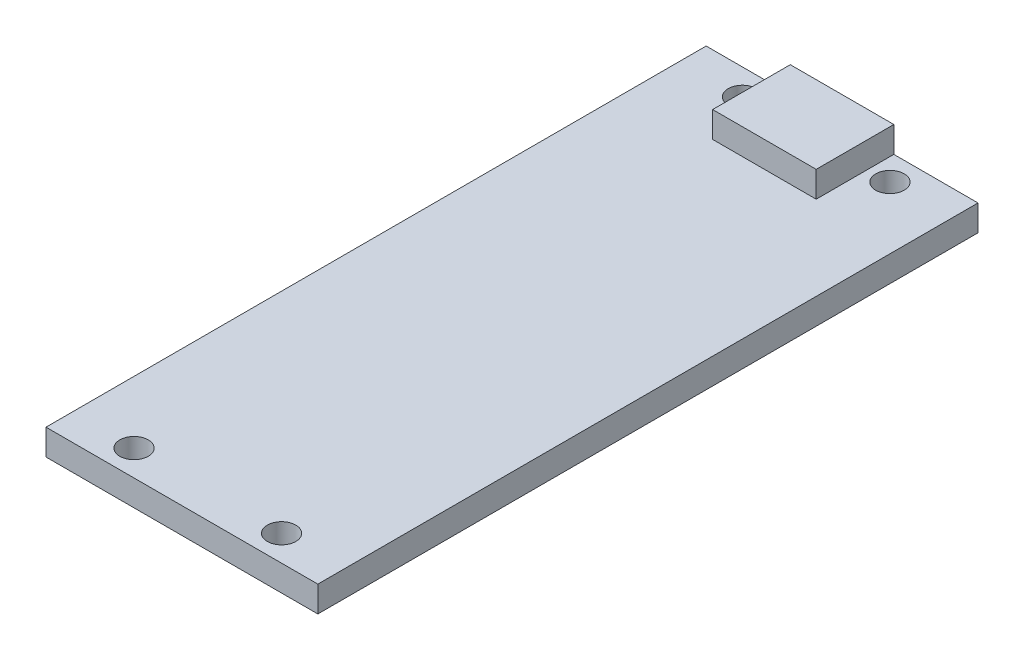
ISO-10303-21;
HEADER;
FILE_DESCRIPTION(('STEP AP214'),'2;1');
FILE_NAME('part.step','',(''),(''),'','','');
FILE_SCHEMA(('AUTOMOTIVE_DESIGN { 1 0 10303 214 1 1 1 1 }'));
ENDSEC;
DATA;
#1=APPLICATION_CONTEXT('core data for automotive mechanical design processes');
#2=APPLICATION_PROTOCOL_DEFINITION('international standard','automotive_design',2000,#1);
#3=PRODUCT_CONTEXT('',#1,'mechanical');
#4=PRODUCT('Part','Part','',(#3));
#5=PRODUCT_RELATED_PRODUCT_CATEGORY('part','',(#4));
#6=PRODUCT_DEFINITION_FORMATION('','',#4);
#7=PRODUCT_DEFINITION_CONTEXT('part definition',#1,'design');
#8=PRODUCT_DEFINITION('design','',#6,#7);
#9=PRODUCT_DEFINITION_SHAPE('','',#8);
#10=(LENGTH_UNIT() NAMED_UNIT(*) SI_UNIT(.MILLI.,.METRE.));
#11=(NAMED_UNIT(*) PLANE_ANGLE_UNIT() SI_UNIT($,.RADIAN.));
#12=(NAMED_UNIT(*) SI_UNIT($,.STERADIAN.) SOLID_ANGLE_UNIT());
#13=UNCERTAINTY_MEASURE_WITH_UNIT(LENGTH_MEASURE(1.E-05),#10,'distance_accuracy_value','');
#14=(GEOMETRIC_REPRESENTATION_CONTEXT(3) GLOBAL_UNCERTAINTY_ASSIGNED_CONTEXT((#13)) GLOBAL_UNIT_ASSIGNED_CONTEXT((#10,
#11,#12)) REPRESENTATION_CONTEXT('',''));
#15=CARTESIAN_POINT('',(0.,0.,0.));
#16=DIRECTION('',(0.,0.,1.));
#17=DIRECTION('',(1.,0.,0.));
#18=AXIS2_PLACEMENT_3D('',#15,#16,#17);
#19=CARTESIAN_POINT('',(-10.5,2.,-25.5));
#20=DIRECTION('',(1.,0.,0.));
#21=DIRECTION('',(0.,0.,-1.));
#22=AXIS2_PLACEMENT_3D('',#19,#20,#21);
#23=PLANE('',#22);
#24=DIRECTION('',(0.,0.,1.));
#25=VECTOR('',#24,1.);
#26=CARTESIAN_POINT('',(-10.5,0.,-25.5));
#27=LINE('',#26,#25);
#28=CARTESIAN_POINT('',(-10.5,0.,-25.5));
#29=VERTEX_POINT('',#28);
#30=CARTESIAN_POINT('',(-10.5,0.,25.5));
#31=VERTEX_POINT('',#30);
#32=EDGE_CURVE('E121',#29,#31,#27,.T.);
#33=ORIENTED_EDGE('',*,*,#32,.T.);
#34=DIRECTION('',(0.,-1.,0.));
#35=VECTOR('',#34,1.);
#36=CARTESIAN_POINT('',(-10.5,2.,25.5));
#37=LINE('',#36,#35);
#38=CARTESIAN_POINT('',(-10.5,2.,25.5));
#39=VERTEX_POINT('',#38);
#40=EDGE_CURVE('E11',#39,#31,#37,.T.);
#41=ORIENTED_EDGE('',*,*,#40,.F.);
#42=DIRECTION('',(0.,0.,1.));
#43=VECTOR('',#42,1.);
#44=CARTESIAN_POINT('',(-10.5,2.,-25.5));
#45=LINE('',#44,#43);
#46=CARTESIAN_POINT('',(-10.5,2.,-25.5));
#47=VERTEX_POINT('',#46);
#48=EDGE_CURVE('E130',#47,#39,#45,.T.);
#49=ORIENTED_EDGE('',*,*,#48,.F.);
#50=DIRECTION('',(0.,-1.,0.));
#51=VECTOR('',#50,1.);
#52=CARTESIAN_POINT('',(-10.5,2.,-25.5));
#53=LINE('',#52,#51);
#54=EDGE_CURVE('E140',#47,#29,#53,.T.);
#55=ORIENTED_EDGE('',*,*,#54,.T.);
#56=EDGE_LOOP('',(#33,#41,#49,#55));
#57=FACE_BOUND('',#56,.T.);
#58=ADVANCED_FACE('F37',(#57),#23,.F.);
#59=CARTESIAN_POINT('',(-10.5,2.,25.5));
#60=DIRECTION('',(0.,0.,-1.));
#61=DIRECTION('',(-1.,0.,0.));
#62=AXIS2_PLACEMENT_3D('',#59,#60,#61);
#63=PLANE('',#62);
#64=DIRECTION('',(1.,0.,0.));
#65=VECTOR('',#64,1.);
#66=CARTESIAN_POINT('',(-10.5,0.,25.5));
#67=LINE('',#66,#65);
#68=CARTESIAN_POINT('',(10.5,0.,25.5));
#69=VERTEX_POINT('',#68);
#70=EDGE_CURVE('E124',#31,#69,#67,.T.);
#71=ORIENTED_EDGE('',*,*,#70,.T.);
#72=DIRECTION('',(0.,-1.,0.));
#73=VECTOR('',#72,1.);
#74=CARTESIAN_POINT('',(10.5,2.,25.5));
#75=LINE('',#74,#73);
#76=CARTESIAN_POINT('',(10.5,2.,25.5));
#77=VERTEX_POINT('',#76);
#78=EDGE_CURVE('E44',#77,#69,#75,.T.);
#79=ORIENTED_EDGE('',*,*,#78,.F.);
#80=DIRECTION('',(1.,0.,0.));
#81=VECTOR('',#80,1.);
#82=CARTESIAN_POINT('',(-10.5,2.,25.5));
#83=LINE('',#82,#81);
#84=EDGE_CURVE('E133',#39,#77,#83,.T.);
#85=ORIENTED_EDGE('',*,*,#84,.F.);
#86=ORIENTED_EDGE('',*,*,#40,.T.);
#87=EDGE_LOOP('',(#71,#79,#85,#86));
#88=FACE_BOUND('',#87,.T.);
#89=ADVANCED_FACE('F229',(#88),#63,.F.);
#90=CARTESIAN_POINT('',(10.5,2.,-25.5));
#91=DIRECTION('',(-1.,0.,0.));
#92=DIRECTION('',(0.,0.,1.));
#93=AXIS2_PLACEMENT_3D('',#90,#91,#92);
#94=PLANE('',#93);
#95=DIRECTION('',(0.,0.,-1.));
#96=VECTOR('',#95,1.);
#97=CARTESIAN_POINT('',(10.5,0.,-25.5));
#98=LINE('',#97,#96);
#99=CARTESIAN_POINT('',(10.5,0.,-25.5));
#100=VERTEX_POINT('',#99);
#101=EDGE_CURVE('E143',#69,#100,#98,.T.);
#102=ORIENTED_EDGE('',*,*,#101,.T.);
#103=DIRECTION('',(0.,-1.,0.));
#104=VECTOR('',#103,1.);
#105=CARTESIAN_POINT('',(10.5,2.,-25.5));
#106=LINE('',#105,#104);
#107=CARTESIAN_POINT('',(10.5,2.,-25.5));
#108=VERTEX_POINT('',#107);
#109=EDGE_CURVE('E148',#108,#100,#106,.T.);
#110=ORIENTED_EDGE('',*,*,#109,.F.);
#111=DIRECTION('',(0.,0.,-1.));
#112=VECTOR('',#111,1.);
#113=CARTESIAN_POINT('',(10.5,2.,-25.5));
#114=LINE('',#113,#112);
#115=EDGE_CURVE('E136',#77,#108,#114,.T.);
#116=ORIENTED_EDGE('',*,*,#115,.F.);
#117=ORIENTED_EDGE('',*,*,#78,.T.);
#118=EDGE_LOOP('',(#102,#110,#116,#117));
#119=FACE_BOUND('',#118,.T.);
#120=ADVANCED_FACE('F155',(#119),#94,.F.);
#121=CARTESIAN_POINT('',(-10.5,2.,-25.5));
#122=DIRECTION('',(0.,0.,1.));
#123=DIRECTION('',(1.,0.,0.));
#124=AXIS2_PLACEMENT_3D('',#121,#122,#123);
#125=PLANE('',#124);
#126=DIRECTION('',(-1.,0.,0.));
#127=VECTOR('',#126,1.);
#128=CARTESIAN_POINT('',(-10.5,0.,-25.5));
#129=LINE('',#128,#127);
#130=EDGE_CURVE('E134',#100,#29,#129,.T.);
#131=ORIENTED_EDGE('',*,*,#130,.T.);
#132=ORIENTED_EDGE('',*,*,#54,.F.);
#133=DIRECTION('',(-1.,0.,0.));
#134=VECTOR('',#133,1.);
#135=CARTESIAN_POINT('',(-10.5,2.,-25.5));
#136=LINE('',#135,#134);
#137=CARTESIAN_POINT('',(-4.,2.,-25.5));
#138=VERTEX_POINT('',#137);
#139=EDGE_CURVE('E138',#138,#47,#136,.T.);
#140=ORIENTED_EDGE('',*,*,#139,.F.);
#141=DIRECTION('',(0.,-1.,0.));
#142=VECTOR('',#141,1.);
#143=CARTESIAN_POINT('',(-4.,4.,-25.5));
#144=LINE('',#143,#142);
#145=CARTESIAN_POINT('',(-4.,4.,-25.5));
#146=VERTEX_POINT('',#145);
#147=EDGE_CURVE('E170',#146,#138,#144,.T.);
#148=ORIENTED_EDGE('',*,*,#147,.F.);
#149=DIRECTION('',(-1.,0.,0.));
#150=VECTOR('',#149,1.);
#151=CARTESIAN_POINT('',(-4.,4.,-25.5));
#152=LINE('',#151,#150);
#153=CARTESIAN_POINT('',(4.,4.,-25.5));
#154=VERTEX_POINT('',#153);
#155=EDGE_CURVE('E114',#154,#146,#152,.T.);
#156=ORIENTED_EDGE('',*,*,#155,.F.);
#157=DIRECTION('',(0.,-1.,0.));
#158=VECTOR('',#157,1.);
#159=CARTESIAN_POINT('',(4.,4.,-25.5));
#160=LINE('',#159,#158);
#161=CARTESIAN_POINT('',(4.,2.,-25.5));
#162=VERTEX_POINT('',#161);
#163=EDGE_CURVE('E126',#154,#162,#160,.T.);
#164=ORIENTED_EDGE('',*,*,#163,.T.);
#165=EDGE_CURVE('E139',#108,#162,#136,.T.);
#166=ORIENTED_EDGE('',*,*,#165,.F.);
#167=ORIENTED_EDGE('',*,*,#109,.T.);
#168=EDGE_LOOP('',(#131,#132,#140,#148,#156,#164,#166,#167));
#169=FACE_BOUND('',#168,.T.);
#170=ADVANCED_FACE('F164',(#169),#125,.F.);
#171=CARTESIAN_POINT('',(0.,2.,0.));
#172=DIRECTION('',(0.,1.,0.));
#173=DIRECTION('',(0.,0.,1.));
#174=AXIS2_PLACEMENT_3D('',#171,#172,#173);
#175=PLANE('',#174);
#176=CARTESIAN_POINT('',(5.7,2.,-23.5));
#177=DIRECTION('',(0.,1.,0.));
#178=DIRECTION('',(0.,0.,1.));
#179=AXIS2_PLACEMENT_3D('',#176,#177,#178);
#180=CIRCLE('',#179,1.1);
#181=CARTESIAN_POINT('',(5.7,2.,-22.4));
#182=VERTEX_POINT('',#181);
#183=EDGE_CURVE('E184',#182,#182,#180,.T.);
#184=ORIENTED_EDGE('',*,*,#183,.F.);
#185=EDGE_LOOP('',(#184));
#186=FACE_BOUND('',#185,.T.);
#187=CARTESIAN_POINT('',(-5.7,2.,23.5));
#188=DIRECTION('',(0.,1.,0.));
#189=DIRECTION('',(0.,0.,1.));
#190=AXIS2_PLACEMENT_3D('',#187,#188,#189);
#191=CIRCLE('',#190,1.1);
#192=CARTESIAN_POINT('',(-5.7,2.,24.6));
#193=VERTEX_POINT('',#192);
#194=EDGE_CURVE('E190',#193,#193,#191,.T.);
#195=ORIENTED_EDGE('',*,*,#194,.F.);
#196=EDGE_LOOP('',(#195));
#197=FACE_BOUND('',#196,.T.);
#198=CARTESIAN_POINT('',(5.7,2.,23.5));
#199=DIRECTION('',(0.,1.,0.));
#200=DIRECTION('',(0.,0.,1.));
#201=AXIS2_PLACEMENT_3D('',#198,#199,#200);
#202=CIRCLE('',#201,1.1);
#203=CARTESIAN_POINT('',(5.7,2.,24.6));
#204=VERTEX_POINT('',#203);
#205=EDGE_CURVE('E191',#204,#204,#202,.T.);
#206=ORIENTED_EDGE('',*,*,#205,.F.);
#207=EDGE_LOOP('',(#206));
#208=FACE_BOUND('',#207,.T.);
#209=CARTESIAN_POINT('',(-5.7,2.,-23.5));
#210=DIRECTION('',(0.,1.,0.));
#211=DIRECTION('',(0.,0.,1.));
#212=AXIS2_PLACEMENT_3D('',#209,#210,#211);
#213=CIRCLE('',#212,1.1);
#214=CARTESIAN_POINT('',(-5.7,2.,-22.4));
#215=VERTEX_POINT('',#214);
#216=EDGE_CURVE('E181',#215,#215,#213,.T.);
#217=ORIENTED_EDGE('',*,*,#216,.F.);
#218=EDGE_LOOP('',(#217));
#219=FACE_BOUND('',#218,.T.);
#220=DIRECTION('',(0.,0.,1.));
#221=VECTOR('',#220,1.);
#222=CARTESIAN_POINT('',(-4.,2.,-25.5));
#223=LINE('',#222,#221);
#224=CARTESIAN_POINT('',(-4.,2.,-19.5));
#225=VERTEX_POINT('',#224);
#226=EDGE_CURVE('E56',#138,#225,#223,.T.);
#227=ORIENTED_EDGE('',*,*,#226,.F.);
#228=ORIENTED_EDGE('',*,*,#139,.T.);
#229=ORIENTED_EDGE('',*,*,#48,.T.);
#230=ORIENTED_EDGE('',*,*,#84,.T.);
#231=ORIENTED_EDGE('',*,*,#115,.T.);
#232=ORIENTED_EDGE('',*,*,#165,.T.);
#233=DIRECTION('',(0.,0.,-1.));
#234=VECTOR('',#233,1.);
#235=CARTESIAN_POINT('',(4.,2.,-25.5));
#236=LINE('',#235,#234);
#237=CARTESIAN_POINT('',(4.,2.,-19.5));
#238=VERTEX_POINT('',#237);
#239=EDGE_CURVE('E118',#238,#162,#236,.T.);
#240=ORIENTED_EDGE('',*,*,#239,.F.);
#241=DIRECTION('',(1.,0.,0.));
#242=VECTOR('',#241,1.);
#243=CARTESIAN_POINT('',(-4.,2.,-19.5));
#244=LINE('',#243,#242);
#245=EDGE_CURVE('E51',#225,#238,#244,.T.);
#246=ORIENTED_EDGE('',*,*,#245,.F.);
#247=EDGE_LOOP('',(#227,#228,#229,#230,#231,#232,#240,#246));
#248=FACE_BOUND('',#247,.T.);
#249=ADVANCED_FACE('F169',(#186,#197,#208,#219,#248),#175,.T.);
#250=CARTESIAN_POINT('',(0.,0.,0.));
#251=DIRECTION('',(0.,1.,0.));
#252=DIRECTION('',(0.,0.,1.));
#253=AXIS2_PLACEMENT_3D('',#250,#251,#252);
#254=PLANE('',#253);
#255=CARTESIAN_POINT('',(5.7,0.,-23.5));
#256=DIRECTION('',(0.,1.,0.));
#257=DIRECTION('',(0.,0.,1.));
#258=AXIS2_PLACEMENT_3D('',#255,#256,#257);
#259=CIRCLE('',#258,1.1);
#260=CARTESIAN_POINT('',(5.7,0.,-22.4));
#261=VERTEX_POINT('',#260);
#262=EDGE_CURVE('E194',#261,#261,#259,.T.);
#263=ORIENTED_EDGE('',*,*,#262,.T.);
#264=EDGE_LOOP('',(#263));
#265=FACE_BOUND('',#264,.T.);
#266=CARTESIAN_POINT('',(-5.7,0.,23.5));
#267=DIRECTION('',(0.,1.,0.));
#268=DIRECTION('',(0.,0.,1.));
#269=AXIS2_PLACEMENT_3D('',#266,#267,#268);
#270=CIRCLE('',#269,1.1);
#271=CARTESIAN_POINT('',(-5.7,0.,24.6));
#272=VERTEX_POINT('',#271);
#273=EDGE_CURVE('E187',#272,#272,#270,.T.);
#274=ORIENTED_EDGE('',*,*,#273,.T.);
#275=EDGE_LOOP('',(#274));
#276=FACE_BOUND('',#275,.T.);
#277=CARTESIAN_POINT('',(5.7,0.,23.5));
#278=DIRECTION('',(0.,1.,0.));
#279=DIRECTION('',(0.,0.,1.));
#280=AXIS2_PLACEMENT_3D('',#277,#278,#279);
#281=CIRCLE('',#280,1.1);
#282=CARTESIAN_POINT('',(5.7,0.,24.6));
#283=VERTEX_POINT('',#282);
#284=EDGE_CURVE('E199',#283,#283,#281,.T.);
#285=ORIENTED_EDGE('',*,*,#284,.T.);
#286=EDGE_LOOP('',(#285));
#287=FACE_BOUND('',#286,.T.);
#288=CARTESIAN_POINT('',(-5.7,0.,-23.5));
#289=DIRECTION('',(0.,1.,0.));
#290=DIRECTION('',(0.,0.,1.));
#291=AXIS2_PLACEMENT_3D('',#288,#289,#290);
#292=CIRCLE('',#291,1.1);
#293=CARTESIAN_POINT('',(-5.7,0.,-22.4));
#294=VERTEX_POINT('',#293);
#295=EDGE_CURVE('E178',#294,#294,#292,.T.);
#296=ORIENTED_EDGE('',*,*,#295,.T.);
#297=EDGE_LOOP('',(#296));
#298=FACE_BOUND('',#297,.T.);
#299=ORIENTED_EDGE('',*,*,#32,.F.);
#300=ORIENTED_EDGE('',*,*,#130,.F.);
#301=ORIENTED_EDGE('',*,*,#101,.F.);
#302=ORIENTED_EDGE('',*,*,#70,.F.);
#303=EDGE_LOOP('',(#299,#300,#301,#302));
#304=FACE_BOUND('',#303,.T.);
#305=ADVANCED_FACE('F161',(#265,#276,#287,#298,#304),#254,.F.);
#306=CARTESIAN_POINT('',(-4.,4.,-25.5));
#307=DIRECTION('',(1.,0.,0.));
#308=DIRECTION('',(0.,0.,-1.));
#309=AXIS2_PLACEMENT_3D('',#306,#307,#308);
#310=PLANE('',#309);
#311=ORIENTED_EDGE('',*,*,#226,.T.);
#312=DIRECTION('',(0.,-1.,0.));
#313=VECTOR('',#312,1.);
#314=CARTESIAN_POINT('',(-4.,4.,-19.5));
#315=LINE('',#314,#313);
#316=CARTESIAN_POINT('',(-4.,4.,-19.5));
#317=VERTEX_POINT('',#316);
#318=EDGE_CURVE('E103',#317,#225,#315,.T.);
#319=ORIENTED_EDGE('',*,*,#318,.F.);
#320=DIRECTION('',(0.,0.,1.));
#321=VECTOR('',#320,1.);
#322=CARTESIAN_POINT('',(-4.,4.,-25.5));
#323=LINE('',#322,#321);
#324=EDGE_CURVE('E109',#146,#317,#323,.T.);
#325=ORIENTED_EDGE('',*,*,#324,.F.);
#326=ORIENTED_EDGE('',*,*,#147,.T.);
#327=EDGE_LOOP('',(#311,#319,#325,#326));
#328=FACE_BOUND('',#327,.T.);
#329=ADVANCED_FACE('F120',(#328),#310,.F.);
#330=CARTESIAN_POINT('',(-4.,4.,-19.5));
#331=DIRECTION('',(0.,0.,-1.));
#332=DIRECTION('',(-1.,0.,0.));
#333=AXIS2_PLACEMENT_3D('',#330,#331,#332);
#334=PLANE('',#333);
#335=ORIENTED_EDGE('',*,*,#245,.T.);
#336=DIRECTION('',(0.,-1.,0.));
#337=VECTOR('',#336,1.);
#338=CARTESIAN_POINT('',(4.,4.,-19.5));
#339=LINE('',#338,#337);
#340=CARTESIAN_POINT('',(4.,4.,-19.5));
#341=VERTEX_POINT('',#340);
#342=EDGE_CURVE('E105',#341,#238,#339,.T.);
#343=ORIENTED_EDGE('',*,*,#342,.F.);
#344=DIRECTION('',(1.,0.,0.));
#345=VECTOR('',#344,1.);
#346=CARTESIAN_POINT('',(-4.,4.,-19.5));
#347=LINE('',#346,#345);
#348=EDGE_CURVE('E99',#317,#341,#347,.T.);
#349=ORIENTED_EDGE('',*,*,#348,.F.);
#350=ORIENTED_EDGE('',*,*,#318,.T.);
#351=EDGE_LOOP('',(#335,#343,#349,#350));
#352=FACE_BOUND('',#351,.T.);
#353=ADVANCED_FACE('F101',(#352),#334,.F.);
#354=CARTESIAN_POINT('',(4.,4.,-25.5));
#355=DIRECTION('',(-1.,0.,0.));
#356=DIRECTION('',(0.,0.,1.));
#357=AXIS2_PLACEMENT_3D('',#354,#355,#356);
#358=PLANE('',#357);
#359=ORIENTED_EDGE('',*,*,#239,.T.);
#360=ORIENTED_EDGE('',*,*,#163,.F.);
#361=DIRECTION('',(0.,0.,-1.));
#362=VECTOR('',#361,1.);
#363=CARTESIAN_POINT('',(4.,4.,-25.5));
#364=LINE('',#363,#362);
#365=EDGE_CURVE('E108',#341,#154,#364,.T.);
#366=ORIENTED_EDGE('',*,*,#365,.F.);
#367=ORIENTED_EDGE('',*,*,#342,.T.);
#368=EDGE_LOOP('',(#359,#360,#366,#367));
#369=FACE_BOUND('',#368,.T.);
#370=ADVANCED_FACE('F224',(#369),#358,.F.);
#371=CARTESIAN_POINT('',(0.,4.,0.));
#372=DIRECTION('',(0.,1.,0.));
#373=DIRECTION('',(0.,0.,1.));
#374=AXIS2_PLACEMENT_3D('',#371,#372,#373);
#375=PLANE('',#374);
#376=ORIENTED_EDGE('',*,*,#324,.T.);
#377=ORIENTED_EDGE('',*,*,#348,.T.);
#378=ORIENTED_EDGE('',*,*,#365,.T.);
#379=ORIENTED_EDGE('',*,*,#155,.T.);
#380=EDGE_LOOP('',(#376,#377,#378,#379));
#381=FACE_BOUND('',#380,.T.);
#382=ADVANCED_FACE('F112',(#381),#375,.T.);
#383=CARTESIAN_POINT('',(-5.7,0.,-23.5));
#384=DIRECTION('',(0.,1.,0.));
#385=DIRECTION('',(0.,0.,1.));
#386=AXIS2_PLACEMENT_3D('',#383,#384,#385);
#387=CYLINDRICAL_SURFACE('',#386,1.1);
#388=ORIENTED_EDGE('',*,*,#295,.F.);
#389=EDGE_LOOP('',(#388));
#390=FACE_BOUND('',#389,.T.);
#391=ORIENTED_EDGE('',*,*,#216,.T.);
#392=EDGE_LOOP('',(#391));
#393=FACE_BOUND('',#392,.T.);
#394=ADVANCED_FACE('F213',(#390,#393),#387,.F.);
#395=CARTESIAN_POINT('',(5.7,0.,23.5));
#396=DIRECTION('',(0.,1.,0.));
#397=DIRECTION('',(0.,0.,1.));
#398=AXIS2_PLACEMENT_3D('',#395,#396,#397);
#399=CYLINDRICAL_SURFACE('',#398,1.1);
#400=ORIENTED_EDGE('',*,*,#284,.F.);
#401=EDGE_LOOP('',(#400));
#402=FACE_BOUND('',#401,.T.);
#403=ORIENTED_EDGE('',*,*,#205,.T.);
#404=EDGE_LOOP('',(#403));
#405=FACE_BOUND('',#404,.T.);
#406=ADVANCED_FACE('F205',(#402,#405),#399,.F.);
#407=CARTESIAN_POINT('',(-5.7,0.,23.5));
#408=DIRECTION('',(0.,1.,0.));
#409=DIRECTION('',(0.,0.,1.));
#410=AXIS2_PLACEMENT_3D('',#407,#408,#409);
#411=CYLINDRICAL_SURFACE('',#410,1.1);
#412=ORIENTED_EDGE('',*,*,#273,.F.);
#413=EDGE_LOOP('',(#412));
#414=FACE_BOUND('',#413,.T.);
#415=ORIENTED_EDGE('',*,*,#194,.T.);
#416=EDGE_LOOP('',(#415));
#417=FACE_BOUND('',#416,.T.);
#418=ADVANCED_FACE('F221',(#414,#417),#411,.F.);
#419=CARTESIAN_POINT('',(5.7,0.,-23.5));
#420=DIRECTION('',(0.,1.,0.));
#421=DIRECTION('',(0.,0.,1.));
#422=AXIS2_PLACEMENT_3D('',#419,#420,#421);
#423=CYLINDRICAL_SURFACE('',#422,1.1);
#424=ORIENTED_EDGE('',*,*,#262,.F.);
#425=EDGE_LOOP('',(#424));
#426=FACE_BOUND('',#425,.T.);
#427=ORIENTED_EDGE('',*,*,#183,.T.);
#428=EDGE_LOOP('',(#427));
#429=FACE_BOUND('',#428,.T.);
#430=ADVANCED_FACE('F296',(#426,#429),#423,.F.);
#431=CLOSED_SHELL('',(#58,#89,#120,#170,#249,#305,#329,#353,#370,#382,#394,#406,#418,#430));
#432=MANIFOLD_SOLID_BREP('B2',#431);
#433=ADVANCED_BREP_SHAPE_REPRESENTATION('',(#18,#432),#14);
#434=SHAPE_DEFINITION_REPRESENTATION(#9,#433);
ENDSEC;
END-ISO-10303-21;
